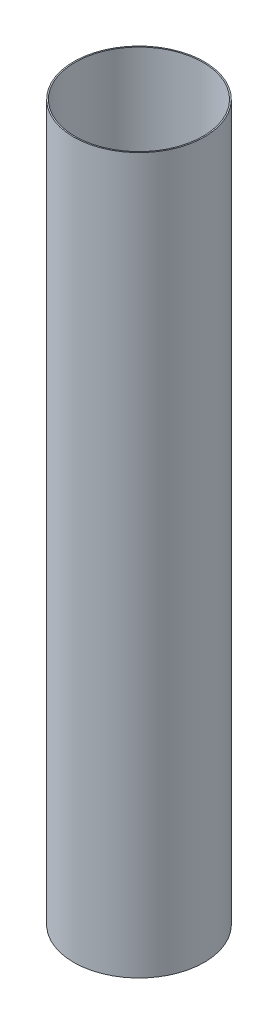
ISO-10303-21;
HEADER;
FILE_DESCRIPTION(('STEP AP214'),'2;1');
FILE_NAME('part.step','',(''),(''),'','','');
FILE_SCHEMA(('AUTOMOTIVE_DESIGN { 1 0 10303 214 1 1 1 1 }'));
ENDSEC;
DATA;
#1=APPLICATION_CONTEXT('core data for automotive mechanical design processes');
#2=APPLICATION_PROTOCOL_DEFINITION('international standard','automotive_design',2000,#1);
#3=PRODUCT_CONTEXT('',#1,'mechanical');
#4=PRODUCT('Part','Part','',(#3));
#5=PRODUCT_RELATED_PRODUCT_CATEGORY('part','',(#4));
#6=PRODUCT_DEFINITION_FORMATION('','',#4);
#7=PRODUCT_DEFINITION_CONTEXT('part definition',#1,'design');
#8=PRODUCT_DEFINITION('design','',#6,#7);
#9=PRODUCT_DEFINITION_SHAPE('','',#8);
#10=(LENGTH_UNIT() NAMED_UNIT(*) SI_UNIT(.MILLI.,.METRE.));
#11=(NAMED_UNIT(*) PLANE_ANGLE_UNIT() SI_UNIT($,.RADIAN.));
#12=(NAMED_UNIT(*) SI_UNIT($,.STERADIAN.) SOLID_ANGLE_UNIT());
#13=UNCERTAINTY_MEASURE_WITH_UNIT(LENGTH_MEASURE(1.E-05),#10,'distance_accuracy_value','');
#14=(GEOMETRIC_REPRESENTATION_CONTEXT(3) GLOBAL_UNCERTAINTY_ASSIGNED_CONTEXT((#13)) GLOBAL_UNIT_ASSIGNED_CONTEXT((#10,
#11,#12)) REPRESENTATION_CONTEXT('',''));
#15=CARTESIAN_POINT('',(0.,0.,0.));
#16=DIRECTION('',(0.,0.,1.));
#17=DIRECTION('',(1.,0.,0.));
#18=AXIS2_PLACEMENT_3D('',#15,#16,#17);
#19=CARTESIAN_POINT('',(0.,736.6,0.));
#20=DIRECTION('',(0.,1.,0.));
#21=DIRECTION('',(0.,0.,1.));
#22=AXIS2_PLACEMENT_3D('',#19,#20,#21);
#23=PLANE('',#22);
#24=CARTESIAN_POINT('',(0.,736.6,0.));
#25=DIRECTION('',(0.,1.,0.));
#26=DIRECTION('',(0.,0.,1.));
#27=AXIS2_PLACEMENT_3D('',#24,#25,#26);
#28=CIRCLE('',#27,67.31);
#29=CARTESIAN_POINT('',(0.,736.6,67.31));
#30=VERTEX_POINT('',#29);
#31=EDGE_CURVE('E10',#30,#30,#28,.T.);
#32=ORIENTED_EDGE('',*,*,#31,.T.);
#33=EDGE_LOOP('',(#32));
#34=FACE_BOUND('',#33,.T.);
#35=CARTESIAN_POINT('',(0.,736.6,0.));
#36=DIRECTION('',(0.,1.,0.));
#37=DIRECTION('',(0.,0.,1.));
#38=AXIS2_PLACEMENT_3D('',#35,#36,#37);
#39=CIRCLE('',#38,66.04);
#40=CARTESIAN_POINT('',(0.,736.6,66.04));
#41=VERTEX_POINT('',#40);
#42=EDGE_CURVE('E41',#41,#41,#39,.T.);
#43=ORIENTED_EDGE('',*,*,#42,.F.);
#44=EDGE_LOOP('',(#43));
#45=FACE_BOUND('',#44,.T.);
#46=ADVANCED_FACE('F30',(#34,#45),#23,.T.);
#47=CARTESIAN_POINT('',(0.,0.,0.));
#48=DIRECTION('',(0.,1.,0.));
#49=DIRECTION('',(0.,0.,1.));
#50=AXIS2_PLACEMENT_3D('',#47,#48,#49);
#51=PLANE('',#50);
#52=CARTESIAN_POINT('',(0.,0.,0.));
#53=DIRECTION('',(0.,1.,0.));
#54=DIRECTION('',(0.,0.,1.));
#55=AXIS2_PLACEMENT_3D('',#52,#53,#54);
#56=CIRCLE('',#55,67.31);
#57=CARTESIAN_POINT('',(0.,0.,67.31));
#58=VERTEX_POINT('',#57);
#59=EDGE_CURVE('E34',#58,#58,#56,.T.);
#60=ORIENTED_EDGE('',*,*,#59,.F.);
#61=EDGE_LOOP('',(#60));
#62=FACE_BOUND('',#61,.T.);
#63=CARTESIAN_POINT('',(0.,0.,0.));
#64=DIRECTION('',(0.,1.,0.));
#65=DIRECTION('',(0.,0.,1.));
#66=AXIS2_PLACEMENT_3D('',#63,#64,#65);
#67=CIRCLE('',#66,66.04);
#68=CARTESIAN_POINT('',(0.,0.,66.04));
#69=VERTEX_POINT('',#68);
#70=EDGE_CURVE('E43',#69,#69,#67,.T.);
#71=ORIENTED_EDGE('',*,*,#70,.T.);
#72=EDGE_LOOP('',(#71));
#73=FACE_BOUND('',#72,.T.);
#74=ADVANCED_FACE('F53',(#62,#73),#51,.F.);
#75=CARTESIAN_POINT('',(0.,736.6,0.));
#76=DIRECTION('',(0.,-1.,0.));
#77=DIRECTION('',(0.,0.,-1.));
#78=AXIS2_PLACEMENT_3D('',#75,#76,#77);
#79=CYLINDRICAL_SURFACE('',#78,67.31);
#80=ORIENTED_EDGE('',*,*,#31,.F.);
#81=EDGE_LOOP('',(#80));
#82=FACE_BOUND('',#81,.T.);
#83=ORIENTED_EDGE('',*,*,#59,.T.);
#84=EDGE_LOOP('',(#83));
#85=FACE_BOUND('',#84,.T.);
#86=ADVANCED_FACE('F32',(#82,#85),#79,.T.);
#87=CARTESIAN_POINT('',(0.,736.6,0.));
#88=DIRECTION('',(0.,-1.,0.));
#89=DIRECTION('',(0.,0.,-1.));
#90=AXIS2_PLACEMENT_3D('',#87,#88,#89);
#91=CYLINDRICAL_SURFACE('',#90,66.04);
#92=ORIENTED_EDGE('',*,*,#42,.T.);
#93=EDGE_LOOP('',(#92));
#94=FACE_BOUND('',#93,.T.);
#95=ORIENTED_EDGE('',*,*,#70,.F.);
#96=EDGE_LOOP('',(#95));
#97=FACE_BOUND('',#96,.T.);
#98=ADVANCED_FACE('F49',(#94,#97),#91,.F.);
#99=CLOSED_SHELL('',(#46,#74,#86,#98));
#100=MANIFOLD_SOLID_BREP('B2',#99);
#101=ADVANCED_BREP_SHAPE_REPRESENTATION('',(#18,#100),#14);
#102=SHAPE_DEFINITION_REPRESENTATION(#9,#101);
ENDSEC;
END-ISO-10303-21;
